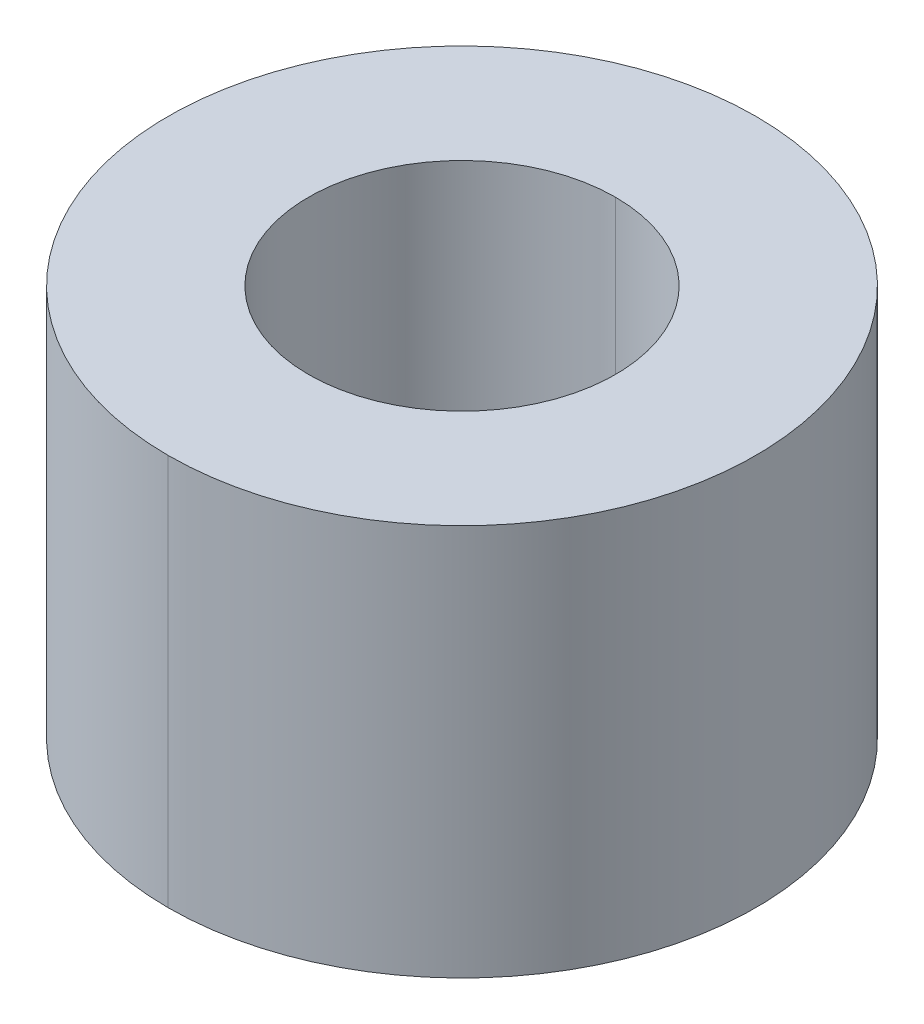
ISO-10303-21;
HEADER;
FILE_DESCRIPTION(('STEP AP214'),'2;1');
FILE_NAME('part.step','',(''),(''),'','','');
FILE_SCHEMA(('AUTOMOTIVE_DESIGN { 1 0 10303 214 1 1 1 1 }'));
ENDSEC;
DATA;
#1=APPLICATION_CONTEXT('core data for automotive mechanical design processes');
#2=APPLICATION_PROTOCOL_DEFINITION('international standard','automotive_design',2000,#1);
#3=PRODUCT_CONTEXT('',#1,'mechanical');
#4=PRODUCT('Part','Part','',(#3));
#5=PRODUCT_RELATED_PRODUCT_CATEGORY('part','',(#4));
#6=PRODUCT_DEFINITION_FORMATION('','',#4);
#7=PRODUCT_DEFINITION_CONTEXT('part definition',#1,'design');
#8=PRODUCT_DEFINITION('design','',#6,#7);
#9=PRODUCT_DEFINITION_SHAPE('','',#8);
#10=(LENGTH_UNIT() NAMED_UNIT(*) SI_UNIT(.MILLI.,.METRE.));
#11=(NAMED_UNIT(*) PLANE_ANGLE_UNIT() SI_UNIT($,.RADIAN.));
#12=(NAMED_UNIT(*) SI_UNIT($,.STERADIAN.) SOLID_ANGLE_UNIT());
#13=UNCERTAINTY_MEASURE_WITH_UNIT(LENGTH_MEASURE(1.E-05),#10,'distance_accuracy_value','');
#14=(GEOMETRIC_REPRESENTATION_CONTEXT(3) GLOBAL_UNCERTAINTY_ASSIGNED_CONTEXT((#13)) GLOBAL_UNIT_ASSIGNED_CONTEXT((#10,
#11,#12)) REPRESENTATION_CONTEXT('',''));
#15=CARTESIAN_POINT('',(0.,0.,0.));
#16=DIRECTION('',(0.,0.,1.));
#17=DIRECTION('',(1.,0.,0.));
#18=AXIS2_PLACEMENT_3D('',#15,#16,#17);
#19=CARTESIAN_POINT('',(0.,-3.175,0.));
#20=DIRECTION('',(0.,1.,0.));
#21=DIRECTION('',(0.,0.,1.));
#22=AXIS2_PLACEMENT_3D('',#19,#20,#21);
#23=CYLINDRICAL_SURFACE('',#22,2.4892);
#24=DIRECTION('',(0.,1.,0.));
#25=VECTOR('',#24,1.);
#26=CARTESIAN_POINT('',(0.,-3.175,-2.4892));
#27=LINE('',#26,#25);
#28=CARTESIAN_POINT('',(0.,-3.175,-2.4892));
#29=VERTEX_POINT('',#28);
#30=CARTESIAN_POINT('',(0.,3.175,-2.4892));
#31=VERTEX_POINT('',#30);
#32=EDGE_CURVE('E87',#29,#31,#27,.T.);
#33=ORIENTED_EDGE('',*,*,#32,.F.);
#34=CARTESIAN_POINT('',(0.,-3.175,0.));
#35=DIRECTION('',(0.,-1.,0.));
#36=DIRECTION('',(0.,0.,-1.));
#37=AXIS2_PLACEMENT_3D('',#34,#35,#36);
#38=CIRCLE('',#37,2.4892);
#39=CARTESIAN_POINT('',(0.,-3.175,2.4892));
#40=VERTEX_POINT('',#39);
#41=EDGE_CURVE('E11',#29,#40,#38,.T.);
#42=ORIENTED_EDGE('',*,*,#41,.T.);
#43=DIRECTION('',(0.,1.,0.));
#44=VECTOR('',#43,1.);
#45=CARTESIAN_POINT('',(0.,-3.175,2.4892));
#46=LINE('',#45,#44);
#47=CARTESIAN_POINT('',(0.,3.175,2.4892));
#48=VERTEX_POINT('',#47);
#49=EDGE_CURVE('E84',#40,#48,#46,.T.);
#50=ORIENTED_EDGE('',*,*,#49,.T.);
#51=CARTESIAN_POINT('',(0.,3.175,0.));
#52=DIRECTION('',(0.,-1.,0.));
#53=DIRECTION('',(0.,0.,-1.));
#54=AXIS2_PLACEMENT_3D('',#51,#52,#53);
#55=CIRCLE('',#54,2.4892);
#56=EDGE_CURVE('E61',#31,#48,#55,.T.);
#57=ORIENTED_EDGE('',*,*,#56,.F.);
#58=EDGE_LOOP('',(#33,#42,#50,#57));
#59=FACE_BOUND('',#58,.T.);
#60=ADVANCED_FACE('F17',(#59),#23,.F.);
#61=CARTESIAN_POINT('',(0.,-3.175,0.));
#62=DIRECTION('',(0.,1.,0.));
#63=DIRECTION('',(0.,0.,1.));
#64=AXIS2_PLACEMENT_3D('',#61,#62,#63);
#65=CYLINDRICAL_SURFACE('',#64,4.7625);
#66=DIRECTION('',(0.,1.,0.));
#67=VECTOR('',#66,1.);
#68=CARTESIAN_POINT('',(0.,-3.175,-4.7625));
#69=LINE('',#68,#67);
#70=CARTESIAN_POINT('',(0.,-3.175,-4.7625));
#71=VERTEX_POINT('',#70);
#72=CARTESIAN_POINT('',(0.,3.175,-4.7625));
#73=VERTEX_POINT('',#72);
#74=EDGE_CURVE('E112',#71,#73,#69,.T.);
#75=ORIENTED_EDGE('',*,*,#74,.F.);
#76=CARTESIAN_POINT('',(0.,-3.175,0.));
#77=DIRECTION('',(0.,-1.,0.));
#78=DIRECTION('',(0.,0.,-1.));
#79=AXIS2_PLACEMENT_3D('',#76,#77,#78);
#80=CIRCLE('',#79,4.7625);
#81=CARTESIAN_POINT('',(0.,-3.175,4.7625));
#82=VERTEX_POINT('',#81);
#83=EDGE_CURVE('E25',#82,#71,#80,.T.);
#84=ORIENTED_EDGE('',*,*,#83,.F.);
#85=DIRECTION('',(0.,1.,0.));
#86=VECTOR('',#85,1.);
#87=CARTESIAN_POINT('',(0.,-3.175,4.7625));
#88=LINE('',#87,#86);
#89=CARTESIAN_POINT('',(0.,3.175,4.7625));
#90=VERTEX_POINT('',#89);
#91=EDGE_CURVE('E120',#82,#90,#88,.T.);
#92=ORIENTED_EDGE('',*,*,#91,.T.);
#93=CARTESIAN_POINT('',(0.,3.175,0.));
#94=DIRECTION('',(0.,-1.,0.));
#95=DIRECTION('',(0.,0.,-1.));
#96=AXIS2_PLACEMENT_3D('',#93,#94,#95);
#97=CIRCLE('',#96,4.7625);
#98=EDGE_CURVE('E37',#90,#73,#97,.T.);
#99=ORIENTED_EDGE('',*,*,#98,.T.);
#100=EDGE_LOOP('',(#75,#84,#92,#99));
#101=FACE_BOUND('',#100,.T.);
#102=ADVANCED_FACE('F218',(#101),#65,.T.);
#103=CARTESIAN_POINT('',(0.,-3.175,0.));
#104=DIRECTION('',(0.,-1.,0.));
#105=DIRECTION('',(0.,0.,-1.));
#106=AXIS2_PLACEMENT_3D('',#103,#104,#105);
#107=PLANE('',#106);
#108=CARTESIAN_POINT('',(0.,-3.175,0.));
#109=DIRECTION('',(0.,-1.,0.));
#110=DIRECTION('',(0.,0.,-1.));
#111=AXIS2_PLACEMENT_3D('',#108,#109,#110);
#112=CIRCLE('',#111,2.4892);
#113=EDGE_CURVE('E91',#40,#29,#112,.T.);
#114=ORIENTED_EDGE('',*,*,#113,.F.);
#115=ORIENTED_EDGE('',*,*,#41,.F.);
#116=EDGE_LOOP('',(#114,#115));
#117=FACE_BOUND('',#116,.T.);
#118=ORIENTED_EDGE('',*,*,#83,.T.);
#119=CARTESIAN_POINT('',(0.,-3.175,0.));
#120=DIRECTION('',(0.,-1.,0.));
#121=DIRECTION('',(0.,0.,-1.));
#122=AXIS2_PLACEMENT_3D('',#119,#120,#121);
#123=CIRCLE('',#122,4.7625);
#124=EDGE_CURVE('E94',#71,#82,#123,.T.);
#125=ORIENTED_EDGE('',*,*,#124,.T.);
#126=EDGE_LOOP('',(#118,#125));
#127=FACE_BOUND('',#126,.T.);
#128=ADVANCED_FACE('F96',(#117,#127),#107,.T.);
#129=CARTESIAN_POINT('',(0.,3.175,0.));
#130=DIRECTION('',(0.,-1.,0.));
#131=DIRECTION('',(0.,0.,-1.));
#132=AXIS2_PLACEMENT_3D('',#129,#130,#131);
#133=PLANE('',#132);
#134=CARTESIAN_POINT('',(0.,3.175,0.));
#135=DIRECTION('',(0.,-1.,0.));
#136=DIRECTION('',(0.,0.,-1.));
#137=AXIS2_PLACEMENT_3D('',#134,#135,#136);
#138=CIRCLE('',#137,2.4892);
#139=EDGE_CURVE('E92',#48,#31,#138,.T.);
#140=ORIENTED_EDGE('',*,*,#139,.T.);
#141=ORIENTED_EDGE('',*,*,#56,.T.);
#142=EDGE_LOOP('',(#140,#141));
#143=FACE_BOUND('',#142,.T.);
#144=ORIENTED_EDGE('',*,*,#98,.F.);
#145=CARTESIAN_POINT('',(0.,3.175,0.));
#146=DIRECTION('',(0.,-1.,0.));
#147=DIRECTION('',(0.,0.,-1.));
#148=AXIS2_PLACEMENT_3D('',#145,#146,#147);
#149=CIRCLE('',#148,4.7625);
#150=EDGE_CURVE('E116',#73,#90,#149,.T.);
#151=ORIENTED_EDGE('',*,*,#150,.F.);
#152=EDGE_LOOP('',(#144,#151));
#153=FACE_BOUND('',#152,.T.);
#154=ADVANCED_FACE('F202',(#143,#153),#133,.F.);
#155=CARTESIAN_POINT('',(0.,-3.175,0.));
#156=DIRECTION('',(0.,1.,0.));
#157=DIRECTION('',(0.,0.,1.));
#158=AXIS2_PLACEMENT_3D('',#155,#156,#157);
#159=CYLINDRICAL_SURFACE('',#158,4.7625);
#160=ORIENTED_EDGE('',*,*,#124,.F.);
#161=ORIENTED_EDGE('',*,*,#74,.T.);
#162=ORIENTED_EDGE('',*,*,#150,.T.);
#163=ORIENTED_EDGE('',*,*,#91,.F.);
#164=EDGE_LOOP('',(#160,#161,#162,#163));
#165=FACE_BOUND('',#164,.T.);
#166=ADVANCED_FACE('F194',(#165),#159,.T.);
#167=CARTESIAN_POINT('',(0.,-3.175,0.));
#168=DIRECTION('',(0.,1.,0.));
#169=DIRECTION('',(0.,0.,1.));
#170=AXIS2_PLACEMENT_3D('',#167,#168,#169);
#171=CYLINDRICAL_SURFACE('',#170,2.4892);
#172=ORIENTED_EDGE('',*,*,#113,.T.);
#173=ORIENTED_EDGE('',*,*,#32,.T.);
#174=ORIENTED_EDGE('',*,*,#139,.F.);
#175=ORIENTED_EDGE('',*,*,#49,.F.);
#176=EDGE_LOOP('',(#172,#173,#174,#175));
#177=FACE_BOUND('',#176,.T.);
#178=ADVANCED_FACE('F90',(#177),#171,.F.);
#179=CLOSED_SHELL('',(#60,#102,#128,#154,#166,#178));
#180=MANIFOLD_SOLID_BREP('B1',#179);
#181=ADVANCED_BREP_SHAPE_REPRESENTATION('',(#18,#180),#14);
#182=SHAPE_DEFINITION_REPRESENTATION(#9,#181);
ENDSEC;
END-ISO-10303-21;
